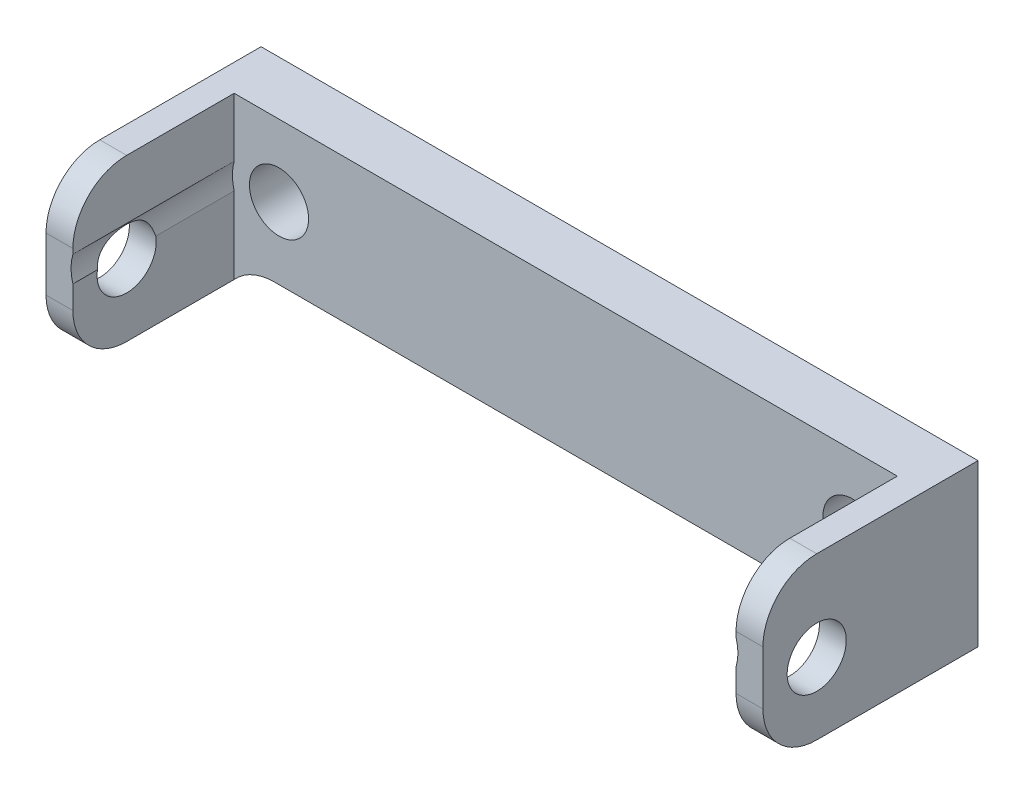
ISO-10303-21;
HEADER;
FILE_DESCRIPTION(('STEP AP214'),'2;1');
FILE_NAME('part.step','',(''),(''),'','','');
FILE_SCHEMA(('AUTOMOTIVE_DESIGN { 1 0 10303 214 1 1 1 1 }'));
ENDSEC;
DATA;
#1=APPLICATION_CONTEXT('core data for automotive mechanical design processes');
#2=APPLICATION_PROTOCOL_DEFINITION('international standard','automotive_design',2000,#1);
#3=PRODUCT_CONTEXT('',#1,'mechanical');
#4=PRODUCT('Part','Part','',(#3));
#5=PRODUCT_RELATED_PRODUCT_CATEGORY('part','',(#4));
#6=PRODUCT_DEFINITION_FORMATION('','',#4);
#7=PRODUCT_DEFINITION_CONTEXT('part definition',#1,'design');
#8=PRODUCT_DEFINITION('design','',#6,#7);
#9=PRODUCT_DEFINITION_SHAPE('','',#8);
#10=(LENGTH_UNIT() NAMED_UNIT(*) SI_UNIT(.MILLI.,.METRE.));
#11=(NAMED_UNIT(*) PLANE_ANGLE_UNIT() SI_UNIT($,.RADIAN.));
#12=(NAMED_UNIT(*) SI_UNIT($,.STERADIAN.) SOLID_ANGLE_UNIT());
#13=UNCERTAINTY_MEASURE_WITH_UNIT(LENGTH_MEASURE(1.E-05),#10,'distance_accuracy_value','');
#14=(GEOMETRIC_REPRESENTATION_CONTEXT(3) GLOBAL_UNCERTAINTY_ASSIGNED_CONTEXT((#13)) GLOBAL_UNIT_ASSIGNED_CONTEXT((#10,
#11,#12)) REPRESENTATION_CONTEXT('',''));
#15=CARTESIAN_POINT('',(0.,0.,0.));
#16=DIRECTION('',(0.,0.,1.));
#17=DIRECTION('',(1.,0.,0.));
#18=AXIS2_PLACEMENT_3D('',#15,#16,#17);
#19=CARTESIAN_POINT('',(18.5,0.,0.));
#20=DIRECTION('',(1.,0.,0.));
#21=DIRECTION('',(0.,0.,1.));
#22=AXIS2_PLACEMENT_3D('',#19,#20,#21);
#23=PLANE('',#22);
#24=DIRECTION('',(0.,0.,1.));
#25=VECTOR('',#24,1.);
#26=CARTESIAN_POINT('',(18.5,0.714142842854289,-4.35391052434009));
#27=LINE('',#26,#25);
#28=CARTESIAN_POINT('',(18.5,0.714142842854289,12.));
#29=VERTEX_POINT('',#28);
#30=CARTESIAN_POINT('',(18.5,0.714142842854289,3.));
#31=VERTEX_POINT('',#30);
#32=EDGE_CURVE('E179',#29,#31,#27,.F.);
#33=ORIENTED_EDGE('',*,*,#32,.F.);
#34=DIRECTION('',(0.,1.,0.));
#35=VECTOR('',#34,1.);
#36=CARTESIAN_POINT('',(18.5,-5.,12.));
#37=LINE('',#36,#35);
#38=CARTESIAN_POINT('',(18.5,1.,12.));
#39=VERTEX_POINT('',#38);
#40=EDGE_CURVE('E400',#29,#39,#37,.T.);
#41=ORIENTED_EDGE('',*,*,#40,.T.);
#42=CARTESIAN_POINT('',(18.5,1.,9.));
#43=DIRECTION('',(1.,0.,0.));
#44=DIRECTION('',(0.,0.,-1.));
#45=AXIS2_PLACEMENT_3D('',#42,#43,#44);
#46=CIRCLE('',#45,3.);
#47=CARTESIAN_POINT('',(18.5,4.,9.));
#48=VERTEX_POINT('',#47);
#49=EDGE_CURVE('E317',#39,#48,#46,.F.);
#50=ORIENTED_EDGE('',*,*,#49,.T.);
#51=DIRECTION('',(0.,0.,-1.));
#52=VECTOR('',#51,1.);
#53=CARTESIAN_POINT('',(18.5,4.,12.));
#54=LINE('',#53,#52);
#55=CARTESIAN_POINT('',(18.5,4.,3.));
#56=VERTEX_POINT('',#55);
#57=EDGE_CURVE('E201',#48,#56,#54,.T.);
#58=ORIENTED_EDGE('',*,*,#57,.T.);
#59=DIRECTION('',(0.,1.,0.));
#60=VECTOR('',#59,1.);
#61=CARTESIAN_POINT('',(18.5,0.,3.));
#62=LINE('',#61,#60);
#63=EDGE_CURVE('E194',#31,#56,#62,.T.);
#64=ORIENTED_EDGE('',*,*,#63,.F.);
#65=EDGE_LOOP('',(#33,#41,#50,#58,#64));
#66=FACE_BOUND('',#65,.T.);
#67=ADVANCED_FACE('F32',(#66),#23,.F.);
#68=DIRECTION('',(0.,0.,1.));
#69=VECTOR('',#68,1.);
#70=CARTESIAN_POINT('',(18.5,-0.714142842854289,-4.35391052434009));
#71=LINE('',#70,#69);
#72=CARTESIAN_POINT('',(18.5,-0.714142842854289,3.));
#73=VERTEX_POINT('',#72);
#74=CARTESIAN_POINT('',(18.5,-0.714142842854289,7.37495055899564));
#75=VERTEX_POINT('',#74);
#76=EDGE_CURVE('E53',#73,#75,#71,.T.);
#77=ORIENTED_EDGE('',*,*,#76,.F.);
#78=CARTESIAN_POINT('',(18.5,-5.,3.));
#79=VERTEX_POINT('',#78);
#80=EDGE_CURVE('E197',#79,#73,#62,.T.);
#81=ORIENTED_EDGE('',*,*,#80,.F.);
#82=DIRECTION('',(0.,0.,1.));
#83=VECTOR('',#82,1.);
#84=CARTESIAN_POINT('',(18.5,-5.,0.));
#85=LINE('',#84,#83);
#86=CARTESIAN_POINT('',(18.5,-5.,9.));
#87=VERTEX_POINT('',#86);
#88=EDGE_CURVE('E388',#79,#87,#85,.T.);
#89=ORIENTED_EDGE('',*,*,#88,.T.);
#90=CARTESIAN_POINT('',(18.5,-2.,9.));
#91=DIRECTION('',(1.,0.,0.));
#92=DIRECTION('',(0.,0.,-1.));
#93=AXIS2_PLACEMENT_3D('',#90,#91,#92);
#94=CIRCLE('',#93,3.);
#95=CARTESIAN_POINT('',(18.5,-2.,12.));
#96=VERTEX_POINT('',#95);
#97=EDGE_CURVE('E361',#87,#96,#94,.F.);
#98=ORIENTED_EDGE('',*,*,#97,.T.);
#99=CARTESIAN_POINT('',(18.5,-0.714142842854289,12.));
#100=VERTEX_POINT('',#99);
#101=EDGE_CURVE('E391',#96,#100,#37,.T.);
#102=ORIENTED_EDGE('',*,*,#101,.T.);
#103=CARTESIAN_POINT('',(18.5,-0.714142842854289,10.6250494410044));
#104=VERTEX_POINT('',#103);
#105=EDGE_CURVE('E198',#104,#100,#71,.T.);
#106=ORIENTED_EDGE('',*,*,#105,.F.);
#107=CARTESIAN_POINT('',(18.5,-1.,9.));
#108=DIRECTION('',(-1.,0.,0.));
#109=DIRECTION('',(0.,0.,1.));
#110=AXIS2_PLACEMENT_3D('',#107,#108,#109);
#111=CIRCLE('',#110,1.65);
#112=EDGE_CURVE('E399',#75,#104,#111,.T.);
#113=ORIENTED_EDGE('',*,*,#112,.F.);
#114=EDGE_LOOP('',(#77,#81,#89,#98,#102,#106,#113));
#115=FACE_BOUND('',#114,.T.);
#116=ADVANCED_FACE('F338',(#115),#23,.F.);
#117=CARTESIAN_POINT('',(18.5,-1.,9.));
#118=DIRECTION('',(1.,0.,0.));
#119=DIRECTION('',(0.,0.,-1.));
#120=AXIS2_PLACEMENT_3D('',#117,#118,#119);
#121=CYLINDRICAL_SURFACE('',#120,1.65);
#122=CARTESIAN_POINT('',(20.,-1.,9.));
#123=DIRECTION('',(-1.,0.,0.));
#124=DIRECTION('',(0.,0.,1.));
#125=AXIS2_PLACEMENT_3D('',#122,#123,#124);
#126=CIRCLE('',#125,1.65);
#127=CARTESIAN_POINT('',(20.,-1.,10.65));
#128=VERTEX_POINT('',#127);
#129=EDGE_CURVE('E188',#128,#128,#126,.T.);
#130=ORIENTED_EDGE('',*,*,#129,.F.);
#131=EDGE_LOOP('',(#130));
#132=FACE_BOUND('',#131,.T.);
#133=ORIENTED_EDGE('',*,*,#112,.T.);
#134=CARTESIAN_POINT('',(18.5,-0.714142842854289,10.6250494410044));
#135=CARTESIAN_POINT('',(18.5112002641301,-0.674963148021333,10.6181656181267));
#136=CARTESIAN_POINT('',(18.5213955006599,-0.635756650168365,10.6098001749673));
#137=CARTESIAN_POINT('',(18.5398118219877,-0.557633663923848,10.5901030763082));
#138=CARTESIAN_POINT('',(18.5480332389028,-0.518717127812292,10.5787719204942));
#139=CARTESIAN_POINT('',(18.5625121881789,-0.441660633773743,10.5531900241132));
#140=CARTESIAN_POINT('',(18.5687775403161,-0.40351816881584,10.5389512951452));
#141=CARTESIAN_POINT('',(18.5794850737174,-0.328186728807253,10.5075922435592));
#142=CARTESIAN_POINT('',(18.5839272860553,-0.290997737515662,10.4904719700613));
#143=CARTESIAN_POINT('',(18.5947058792569,-0.181323126524409,10.4349089077362));
#144=CARTESIAN_POINT('',(18.5985058300217,-0.110664973550308,10.3922424395216));
#145=CARTESIAN_POINT('',(18.6007638832804,0.0235186807734739,10.2968077126242));
#146=CARTESIAN_POINT('',(18.5992185626588,0.0870395845339693,10.2440330010547));
#147=CARTESIAN_POINT('',(18.5924402577824,0.20737958749524,10.1278118411849));
#148=CARTESIAN_POINT('',(18.587085944113,0.263904335064964,10.0640680588727));
#149=CARTESIAN_POINT('',(18.5745689017903,0.366428331698654,9.92875658729636));
#150=CARTESIAN_POINT('',(18.5674052917974,0.41242243022477,9.85718509468111));
#151=CARTESIAN_POINT('',(18.5525951353871,0.496207391415172,9.70163517556041));
#152=CARTESIAN_POINT('',(18.5449574847043,0.533008876574704,9.61712032706635));
#153=CARTESIAN_POINT('',(18.5318710870563,0.592074076040213,9.44300067534401));
#154=CARTESIAN_POINT('',(18.526421972392,0.614340232841647,9.35339673003232));
#155=CARTESIAN_POINT('',(18.5191088274974,0.643681621834425,9.17128760592471));
#156=CARTESIAN_POINT('',(18.5172560106779,0.650709347898161,9.07877426376673));
#157=CARTESIAN_POINT('',(18.5176515619581,0.649177468321693,8.89389443081547));
#158=CARTESIAN_POINT('',(18.5198995102909,0.640619458085751,8.80152792596013));
#159=CARTESIAN_POINT('',(18.5278055230787,0.608650138985056,8.62205850380448));
#160=CARTESIAN_POINT('',(18.5333734968331,0.58563040234764,8.53488118505168));
#161=CARTESIAN_POINT('',(18.5464643105675,0.525786646079553,8.3655352783981));
#162=CARTESIAN_POINT('',(18.5539878992446,0.48895733713012,8.28336862371112));
#163=CARTESIAN_POINT('',(18.5692366497016,0.40130737225064,8.12403114947191));
#164=CARTESIAN_POINT('',(18.57696191221,0.350144426282177,8.04704839354661));
#165=CARTESIAN_POINT('',(18.5899468381871,0.235563676466304,7.90255808113818));
#166=CARTESIAN_POINT('',(18.5952067765206,0.172147239903009,7.83504946894897));
#167=CARTESIAN_POINT('',(18.6006687780622,0.0349210511148269,7.71161614382046));
#168=CARTESIAN_POINT('',(18.6008822808755,-0.0388648126259045,7.65566551615414));
#169=CARTESIAN_POINT('',(18.5938790207487,-0.194491333886152,7.55704735164802));
#170=CARTESIAN_POINT('',(18.5866717878813,-0.276321538539568,7.51436286931238));
#171=CARTESIAN_POINT('',(18.5668384133902,-0.417983131154916,7.45479705091917));
#172=CARTESIAN_POINT('',(18.5566567356135,-0.476557858798861,7.43402574615374));
#173=CARTESIAN_POINT('',(18.5317775045769,-0.594813717389484,7.39932787439475));
#174=CARTESIAN_POINT('',(18.5170766485,-0.65449562743892,7.38540633292944));
#175=CARTESIAN_POINT('',(18.5,-0.714142842854289,7.37495055899564));
#176=B_SPLINE_CURVE_WITH_KNOTS('',3,(#134,#135,#136,#137,#138,#139,#140,#141,#142,#143,#144,
#145,#146,#147,#148,#149,#150,#151,#152,#153,#154,#155,#156,#157,#158,#159,#160,#161,#162,#163,
#164,#165,#166,#167,#168,#169,#170,#171,#172,#173,#174,#175),.UNSPECIFIED.,.F.,.F.,(4,2,2,2,2,2,
2,2,2,2,2,2,2,2,2,2,2,2,2,2,4),(0.,0.123940731596514,0.247860594146849,0.371278522765075,
0.494694347756643,0.741320735951038,0.988105093093169,1.24312415414578,1.49826767977024,
1.77445348885693,2.05059287612694,2.32759190337916,2.60456257774635,2.87433923395027,
3.14421932527272,3.42119260806131,3.69813500310403,3.97444954582673,4.25040967393518,
4.43882353318531,4.6273754223823),.UNSPECIFIED.);
#177=EDGE_CURVE('E11',#104,#75,#176,.T.);
#178=ORIENTED_EDGE('',*,*,#177,.T.);
#179=EDGE_LOOP('',(#133,#178));
#180=FACE_BOUND('',#179,.T.);
#181=ADVANCED_FACE('F339',(#132,#180),#121,.F.);
#182=CARTESIAN_POINT('',(0.,0.,3.));
#183=DIRECTION('',(0.,0.,1.));
#184=DIRECTION('',(1.,0.,0.));
#185=AXIS2_PLACEMENT_3D('',#182,#183,#184);
#186=PLANE('',#185);
#187=CARTESIAN_POINT('',(-16.,0.,3.));
#188=DIRECTION('',(0.,0.,1.));
#189=DIRECTION('',(1.,0.,0.));
#190=AXIS2_PLACEMENT_3D('',#187,#188,#189);
#191=CIRCLE('',#190,1.65);
#192=CARTESIAN_POINT('',(-14.35,0.,3.));
#193=VERTEX_POINT('',#192);
#194=EDGE_CURVE('E258',#193,#193,#191,.T.);
#195=ORIENTED_EDGE('',*,*,#194,.F.);
#196=EDGE_LOOP('',(#195));
#197=FACE_BOUND('',#196,.T.);
#198=ORIENTED_EDGE('',*,*,#80,.T.);
#199=CARTESIAN_POINT('',(16.,0.,3.));
#200=DIRECTION('',(0.,0.,1.));
#201=DIRECTION('',(1.,0.,0.));
#202=AXIS2_PLACEMENT_3D('',#199,#200,#201);
#203=CIRCLE('',#202,2.6);
#204=EDGE_CURVE('E182',#73,#31,#203,.T.);
#205=ORIENTED_EDGE('',*,*,#204,.T.);
#206=ORIENTED_EDGE('',*,*,#63,.T.);
#207=DIRECTION('',(-1.,0.,0.));
#208=VECTOR('',#207,1.);
#209=CARTESIAN_POINT('',(-20.,4.,3.));
#210=LINE('',#209,#208);
#211=CARTESIAN_POINT('',(-18.5,4.,3.));
#212=VERTEX_POINT('',#211);
#213=EDGE_CURVE('E264',#56,#212,#210,.T.);
#214=ORIENTED_EDGE('',*,*,#213,.T.);
#215=DIRECTION('',(0.,-1.,0.));
#216=VECTOR('',#215,1.);
#217=CARTESIAN_POINT('',(-18.5,0.,3.));
#218=LINE('',#217,#216);
#219=CARTESIAN_POINT('',(-18.5,0.714142842854289,3.));
#220=VERTEX_POINT('',#219);
#221=EDGE_CURVE('E248',#212,#220,#218,.T.);
#222=ORIENTED_EDGE('',*,*,#221,.T.);
#223=CARTESIAN_POINT('',(-16.,0.,3.));
#224=DIRECTION('',(0.,0.,1.));
#225=DIRECTION('',(1.,0.,0.));
#226=AXIS2_PLACEMENT_3D('',#223,#224,#225);
#227=CIRCLE('',#226,2.6);
#228=CARTESIAN_POINT('',(-18.5,-0.714142842854289,3.));
#229=VERTEX_POINT('',#228);
#230=EDGE_CURVE('E212',#229,#220,#227,.F.);
#231=ORIENTED_EDGE('',*,*,#230,.F.);
#232=CARTESIAN_POINT('',(-18.5,-5.,3.));
#233=VERTEX_POINT('',#232);
#234=EDGE_CURVE('E247',#229,#233,#218,.T.);
#235=ORIENTED_EDGE('',*,*,#234,.T.);
#236=CARTESIAN_POINT('',(-16.2639320225002,-7.,3.));
#237=DIRECTION('',(0.,0.,1.));
#238=DIRECTION('',(1.,0.,0.));
#239=AXIS2_PLACEMENT_3D('',#236,#237,#238);
#240=CIRCLE('',#239,3.);
#241=CARTESIAN_POINT('',(-16.2639320225002,-4.,3.));
#242=VERTEX_POINT('',#241);
#243=EDGE_CURVE('E304',#233,#242,#240,.F.);
#244=ORIENTED_EDGE('',*,*,#243,.T.);
#245=DIRECTION('',(1.,0.,0.));
#246=VECTOR('',#245,1.);
#247=CARTESIAN_POINT('',(-20.,-4.,3.));
#248=LINE('',#247,#246);
#249=CARTESIAN_POINT('',(16.2639320225002,-4.,3.));
#250=VERTEX_POINT('',#249);
#251=EDGE_CURVE('E266',#242,#250,#248,.T.);
#252=ORIENTED_EDGE('',*,*,#251,.T.);
#253=CARTESIAN_POINT('',(16.2639320225002,-7.,3.));
#254=DIRECTION('',(0.,0.,1.));
#255=DIRECTION('',(1.,0.,0.));
#256=AXIS2_PLACEMENT_3D('',#253,#254,#255);
#257=CIRCLE('',#256,3.);
#258=EDGE_CURVE('E46',#250,#79,#257,.F.);
#259=ORIENTED_EDGE('',*,*,#258,.T.);
#260=EDGE_LOOP('',(#198,#205,#206,#214,#222,#231,#235,#244,#252,#259));
#261=FACE_BOUND('',#260,.T.);
#262=CARTESIAN_POINT('',(16.,0.,3.));
#263=DIRECTION('',(0.,0.,1.));
#264=DIRECTION('',(-1.,0.,0.));
#265=AXIS2_PLACEMENT_3D('',#262,#263,#264);
#266=CIRCLE('',#265,1.65);
#267=CARTESIAN_POINT('',(14.35,0.,3.));
#268=VERTEX_POINT('',#267);
#269=EDGE_CURVE('E252',#268,#268,#266,.T.);
#270=ORIENTED_EDGE('',*,*,#269,.F.);
#271=EDGE_LOOP('',(#270));
#272=FACE_BOUND('',#271,.T.);
#273=ADVANCED_FACE('F192',(#197,#261,#272),#186,.T.);
#274=CARTESIAN_POINT('',(-20.,-4.,3.));
#275=DIRECTION('',(0.,1.,0.));
#276=DIRECTION('',(0.,0.,1.));
#277=AXIS2_PLACEMENT_3D('',#274,#275,#276);
#278=PLANE('',#277);
#279=DIRECTION('',(1.,0.,0.));
#280=VECTOR('',#279,1.);
#281=CARTESIAN_POINT('',(-20.,-4.,0.));
#282=LINE('',#281,#280);
#283=CARTESIAN_POINT('',(-16.2639320225002,-4.,0.));
#284=VERTEX_POINT('',#283);
#285=CARTESIAN_POINT('',(16.2639320225002,-4.,0.));
#286=VERTEX_POINT('',#285);
#287=EDGE_CURVE('E267',#284,#286,#282,.T.);
#288=ORIENTED_EDGE('',*,*,#287,.T.);
#289=DIRECTION('',(0.,0.,1.));
#290=VECTOR('',#289,1.);
#291=CARTESIAN_POINT('',(16.2639320225002,-4.,3.));
#292=LINE('',#291,#290);
#293=EDGE_CURVE('E362',#286,#250,#292,.T.);
#294=ORIENTED_EDGE('',*,*,#293,.T.);
#295=ORIENTED_EDGE('',*,*,#251,.F.);
#296=DIRECTION('',(0.,0.,1.));
#297=VECTOR('',#296,1.);
#298=CARTESIAN_POINT('',(-16.2639320225002,-4.,3.));
#299=LINE('',#298,#297);
#300=EDGE_CURVE('E288',#242,#284,#299,.F.);
#301=ORIENTED_EDGE('',*,*,#300,.T.);
#302=EDGE_LOOP('',(#288,#294,#295,#301));
#303=FACE_BOUND('',#302,.T.);
#304=ADVANCED_FACE('F426',(#303),#278,.F.);
#305=CARTESIAN_POINT('',(-18.5,0.,0.));
#306=DIRECTION('',(-1.,0.,0.));
#307=DIRECTION('',(0.,0.,1.));
#308=AXIS2_PLACEMENT_3D('',#305,#306,#307);
#309=PLANE('',#308);
#310=ORIENTED_EDGE('',*,*,#234,.F.);
#311=DIRECTION('',(0.,0.,1.));
#312=VECTOR('',#311,1.);
#313=CARTESIAN_POINT('',(-18.5,-0.714142842854289,-4.35391052434009));
#314=LINE('',#313,#312);
#315=CARTESIAN_POINT('',(-18.5,-0.714142842854289,7.37495055899564));
#316=VERTEX_POINT('',#315);
#317=EDGE_CURVE('E217',#229,#316,#314,.T.);
#318=ORIENTED_EDGE('',*,*,#317,.T.);
#319=CARTESIAN_POINT('',(-18.5,-1.,9.));
#320=DIRECTION('',(-1.,0.,0.));
#321=DIRECTION('',(0.,0.,1.));
#322=AXIS2_PLACEMENT_3D('',#319,#320,#321);
#323=CIRCLE('',#322,1.65);
#324=CARTESIAN_POINT('',(-18.5,-0.714142842854289,10.6250494410044));
#325=VERTEX_POINT('',#324);
#326=EDGE_CURVE('E222',#316,#325,#323,.T.);
#327=ORIENTED_EDGE('',*,*,#326,.T.);
#328=CARTESIAN_POINT('',(-18.5,-0.714142842854289,12.));
#329=VERTEX_POINT('',#328);
#330=EDGE_CURVE('E214',#325,#329,#314,.T.);
#331=ORIENTED_EDGE('',*,*,#330,.T.);
#332=DIRECTION('',(0.,1.,0.));
#333=VECTOR('',#332,1.);
#334=CARTESIAN_POINT('',(-18.5,-5.,12.));
#335=LINE('',#334,#333);
#336=CARTESIAN_POINT('',(-18.5,-2.,12.));
#337=VERTEX_POINT('',#336);
#338=EDGE_CURVE('E233',#337,#329,#335,.T.);
#339=ORIENTED_EDGE('',*,*,#338,.F.);
#340=CARTESIAN_POINT('',(-18.5,-2.,9.));
#341=DIRECTION('',(-1.,0.,0.));
#342=DIRECTION('',(0.,0.,1.));
#343=AXIS2_PLACEMENT_3D('',#340,#341,#342);
#344=CIRCLE('',#343,3.);
#345=CARTESIAN_POINT('',(-18.5,-5.,9.));
#346=VERTEX_POINT('',#345);
#347=EDGE_CURVE('E286',#337,#346,#344,.F.);
#348=ORIENTED_EDGE('',*,*,#347,.T.);
#349=DIRECTION('',(0.,0.,1.));
#350=VECTOR('',#349,1.);
#351=CARTESIAN_POINT('',(-18.5,-5.,0.));
#352=LINE('',#351,#350);
#353=EDGE_CURVE('E232',#233,#346,#352,.T.);
#354=ORIENTED_EDGE('',*,*,#353,.F.);
#355=EDGE_LOOP('',(#310,#318,#327,#331,#339,#348,#354));
#356=FACE_BOUND('',#355,.T.);
#357=ADVANCED_FACE('F434',(#356),#309,.F.);
#358=CARTESIAN_POINT('',(0.,0.,0.));
#359=DIRECTION('',(0.,0.,1.));
#360=DIRECTION('',(1.,0.,0.));
#361=AXIS2_PLACEMENT_3D('',#358,#359,#360);
#362=PLANE('',#361);
#363=DIRECTION('',(0.,1.,0.));
#364=VECTOR('',#363,1.);
#365=CARTESIAN_POINT('',(20.,4.,0.));
#366=LINE('',#365,#364);
#367=CARTESIAN_POINT('',(20.,-5.,0.));
#368=VERTEX_POINT('',#367);
#369=CARTESIAN_POINT('',(20.,4.,0.));
#370=VERTEX_POINT('',#369);
#371=EDGE_CURVE('E261',#368,#370,#366,.T.);
#372=ORIENTED_EDGE('',*,*,#371,.F.);
#373=DIRECTION('',(1.,0.,0.));
#374=VECTOR('',#373,1.);
#375=CARTESIAN_POINT('',(18.5,-5.,0.));
#376=LINE('',#375,#374);
#377=CARTESIAN_POINT('',(18.5,-5.,0.));
#378=VERTEX_POINT('',#377);
#379=EDGE_CURVE('E203',#378,#368,#376,.T.);
#380=ORIENTED_EDGE('',*,*,#379,.F.);
#381=CARTESIAN_POINT('',(16.2639320225002,-7.,0.));
#382=DIRECTION('',(0.,0.,1.));
#383=DIRECTION('',(1.,0.,0.));
#384=AXIS2_PLACEMENT_3D('',#381,#382,#383);
#385=CIRCLE('',#384,3.);
#386=EDGE_CURVE('E380',#378,#286,#385,.T.);
#387=ORIENTED_EDGE('',*,*,#386,.T.);
#388=ORIENTED_EDGE('',*,*,#287,.F.);
#389=CARTESIAN_POINT('',(-16.2639320225002,-7.,0.));
#390=DIRECTION('',(0.,0.,1.));
#391=DIRECTION('',(1.,0.,0.));
#392=AXIS2_PLACEMENT_3D('',#389,#390,#391);
#393=CIRCLE('',#392,3.);
#394=CARTESIAN_POINT('',(-18.5,-5.,0.));
#395=VERTEX_POINT('',#394);
#396=EDGE_CURVE('E306',#284,#395,#393,.T.);
#397=ORIENTED_EDGE('',*,*,#396,.T.);
#398=DIRECTION('',(-1.,0.,0.));
#399=VECTOR('',#398,1.);
#400=CARTESIAN_POINT('',(-18.5,-5.,0.));
#401=LINE('',#400,#399);
#402=CARTESIAN_POINT('',(-20.,-5.,0.));
#403=VERTEX_POINT('',#402);
#404=EDGE_CURVE('E239',#395,#403,#401,.T.);
#405=ORIENTED_EDGE('',*,*,#404,.T.);
#406=DIRECTION('',(0.,-1.,0.));
#407=VECTOR('',#406,1.);
#408=CARTESIAN_POINT('',(-20.,4.,0.));
#409=LINE('',#408,#407);
#410=CARTESIAN_POINT('',(-20.,4.,0.));
#411=VERTEX_POINT('',#410);
#412=EDGE_CURVE('E275',#411,#403,#409,.T.);
#413=ORIENTED_EDGE('',*,*,#412,.F.);
#414=DIRECTION('',(-1.,0.,0.));
#415=VECTOR('',#414,1.);
#416=CARTESIAN_POINT('',(-20.,4.,0.));
#417=LINE('',#416,#415);
#418=EDGE_CURVE('E273',#370,#411,#417,.T.);
#419=ORIENTED_EDGE('',*,*,#418,.F.);
#420=EDGE_LOOP('',(#372,#380,#387,#388,#397,#405,#413,#419));
#421=FACE_BOUND('',#420,.T.);
#422=CARTESIAN_POINT('',(-16.,0.,0.));
#423=DIRECTION('',(0.,0.,1.));
#424=DIRECTION('',(1.,0.,0.));
#425=AXIS2_PLACEMENT_3D('',#422,#423,#424);
#426=CIRCLE('',#425,1.65);
#427=CARTESIAN_POINT('',(-14.35,0.,0.));
#428=VERTEX_POINT('',#427);
#429=EDGE_CURVE('E255',#428,#428,#426,.T.);
#430=ORIENTED_EDGE('',*,*,#429,.T.);
#431=EDGE_LOOP('',(#430));
#432=FACE_BOUND('',#431,.T.);
#433=CARTESIAN_POINT('',(16.,0.,0.));
#434=DIRECTION('',(0.,0.,1.));
#435=DIRECTION('',(-1.,0.,0.));
#436=AXIS2_PLACEMENT_3D('',#433,#434,#435);
#437=CIRCLE('',#436,1.65);
#438=CARTESIAN_POINT('',(14.35,0.,0.));
#439=VERTEX_POINT('',#438);
#440=EDGE_CURVE('E251',#439,#439,#437,.T.);
#441=ORIENTED_EDGE('',*,*,#440,.T.);
#442=EDGE_LOOP('',(#441));
#443=FACE_BOUND('',#442,.T.);
#444=ADVANCED_FACE('F443',(#421,#432,#443),#362,.F.);
#445=CARTESIAN_POINT('',(20.,4.,3.));
#446=DIRECTION('',(-1.,0.,0.));
#447=DIRECTION('',(0.,0.,1.));
#448=AXIS2_PLACEMENT_3D('',#445,#446,#447);
#449=PLANE('',#448);
#450=DIRECTION('',(0.,1.,0.));
#451=VECTOR('',#450,1.);
#452=CARTESIAN_POINT('',(20.,-5.,12.));
#453=LINE('',#452,#451);
#454=CARTESIAN_POINT('',(20.,-2.,12.));
#455=VERTEX_POINT('',#454);
#456=CARTESIAN_POINT('',(20.,1.,12.));
#457=VERTEX_POINT('',#456);
#458=EDGE_CURVE('E396',#455,#457,#453,.T.);
#459=ORIENTED_EDGE('',*,*,#458,.F.);
#460=CARTESIAN_POINT('',(20.,-2.,9.));
#461=DIRECTION('',(-1.,0.,0.));
#462=DIRECTION('',(0.,0.,1.));
#463=AXIS2_PLACEMENT_3D('',#460,#461,#462);
#464=CIRCLE('',#463,3.);
#465=CARTESIAN_POINT('',(20.,-5.,9.));
#466=VERTEX_POINT('',#465);
#467=EDGE_CURVE('E60',#455,#466,#464,.F.);
#468=ORIENTED_EDGE('',*,*,#467,.T.);
#469=DIRECTION('',(0.,0.,1.));
#470=VECTOR('',#469,1.);
#471=CARTESIAN_POINT('',(20.,-5.,0.));
#472=LINE('',#471,#470);
#473=EDGE_CURVE('E398',#368,#466,#472,.T.);
#474=ORIENTED_EDGE('',*,*,#473,.F.);
#475=ORIENTED_EDGE('',*,*,#371,.T.);
#476=DIRECTION('',(0.,0.,-1.));
#477=VECTOR('',#476,1.);
#478=CARTESIAN_POINT('',(20.,4.,3.));
#479=LINE('',#478,#477);
#480=CARTESIAN_POINT('',(20.,4.,9.));
#481=VERTEX_POINT('',#480);
#482=EDGE_CURVE('E281',#481,#370,#479,.T.);
#483=ORIENTED_EDGE('',*,*,#482,.F.);
#484=CARTESIAN_POINT('',(20.,1.,9.));
#485=DIRECTION('',(-1.,0.,0.));
#486=DIRECTION('',(0.,0.,1.));
#487=AXIS2_PLACEMENT_3D('',#484,#485,#486);
#488=CIRCLE('',#487,3.);
#489=EDGE_CURVE('E374',#481,#457,#488,.F.);
#490=ORIENTED_EDGE('',*,*,#489,.T.);
#491=EDGE_LOOP('',(#459,#468,#474,#475,#483,#490));
#492=FACE_BOUND('',#491,.T.);
#493=ORIENTED_EDGE('',*,*,#129,.T.);
#494=EDGE_LOOP('',(#493));
#495=FACE_BOUND('',#494,.T.);
#496=ADVANCED_FACE('F452',(#492,#495),#449,.F.);
#497=CARTESIAN_POINT('',(-20.,4.,3.));
#498=DIRECTION('',(0.,-1.,0.));
#499=DIRECTION('',(0.,0.,-1.));
#500=AXIS2_PLACEMENT_3D('',#497,#498,#499);
#501=PLANE('',#500);
#502=ORIENTED_EDGE('',*,*,#57,.F.);
#503=DIRECTION('',(1.,0.,0.));
#504=VECTOR('',#503,1.);
#505=CARTESIAN_POINT('',(-20.,4.,9.));
#506=LINE('',#505,#504);
#507=EDGE_CURVE('E360',#48,#481,#506,.T.);
#508=ORIENTED_EDGE('',*,*,#507,.T.);
#509=ORIENTED_EDGE('',*,*,#482,.T.);
#510=ORIENTED_EDGE('',*,*,#418,.T.);
#511=DIRECTION('',(0.,0.,-1.));
#512=VECTOR('',#511,1.);
#513=CARTESIAN_POINT('',(-20.,4.,3.));
#514=LINE('',#513,#512);
#515=CARTESIAN_POINT('',(-20.,4.,9.));
#516=VERTEX_POINT('',#515);
#517=EDGE_CURVE('E270',#516,#411,#514,.T.);
#518=ORIENTED_EDGE('',*,*,#517,.F.);
#519=DIRECTION('',(-1.,0.,0.));
#520=VECTOR('',#519,1.);
#521=CARTESIAN_POINT('',(-18.5,4.,9.));
#522=LINE('',#521,#520);
#523=CARTESIAN_POINT('',(-18.5,4.,9.));
#524=VERTEX_POINT('',#523);
#525=EDGE_CURVE('E302',#516,#524,#522,.F.);
#526=ORIENTED_EDGE('',*,*,#525,.T.);
#527=DIRECTION('',(0.,0.,-1.));
#528=VECTOR('',#527,1.);
#529=CARTESIAN_POINT('',(-18.5,4.,12.));
#530=LINE('',#529,#528);
#531=EDGE_CURVE('E236',#524,#212,#530,.T.);
#532=ORIENTED_EDGE('',*,*,#531,.T.);
#533=ORIENTED_EDGE('',*,*,#213,.F.);
#534=EDGE_LOOP('',(#502,#508,#509,#510,#518,#526,#532,#533));
#535=FACE_BOUND('',#534,.T.);
#536=ADVANCED_FACE('F460',(#535),#501,.F.);
#537=CARTESIAN_POINT('',(-20.,4.,3.));
#538=DIRECTION('',(1.,0.,0.));
#539=DIRECTION('',(0.,0.,-1.));
#540=AXIS2_PLACEMENT_3D('',#537,#538,#539);
#541=PLANE('',#540);
#542=DIRECTION('',(0.,0.,1.));
#543=VECTOR('',#542,1.);
#544=CARTESIAN_POINT('',(-20.,-5.,0.));
#545=LINE('',#544,#543);
#546=CARTESIAN_POINT('',(-20.,-5.,9.));
#547=VERTEX_POINT('',#546);
#548=EDGE_CURVE('E225',#403,#547,#545,.T.);
#549=ORIENTED_EDGE('',*,*,#548,.T.);
#550=CARTESIAN_POINT('',(-20.,-2.,9.));
#551=DIRECTION('',(1.,0.,0.));
#552=DIRECTION('',(0.,0.,-1.));
#553=AXIS2_PLACEMENT_3D('',#550,#551,#552);
#554=CIRCLE('',#553,3.);
#555=CARTESIAN_POINT('',(-20.,-2.,12.));
#556=VERTEX_POINT('',#555);
#557=EDGE_CURVE('E295',#547,#556,#554,.F.);
#558=ORIENTED_EDGE('',*,*,#557,.T.);
#559=DIRECTION('',(0.,1.,0.));
#560=VECTOR('',#559,1.);
#561=CARTESIAN_POINT('',(-20.,-5.,12.));
#562=LINE('',#561,#560);
#563=CARTESIAN_POINT('',(-20.,1.,12.));
#564=VERTEX_POINT('',#563);
#565=EDGE_CURVE('E242',#556,#564,#562,.T.);
#566=ORIENTED_EDGE('',*,*,#565,.T.);
#567=CARTESIAN_POINT('',(-20.,1.,9.));
#568=DIRECTION('',(1.,0.,0.));
#569=DIRECTION('',(0.,0.,-1.));
#570=AXIS2_PLACEMENT_3D('',#567,#568,#569);
#571=CIRCLE('',#570,3.);
#572=EDGE_CURVE('E293',#564,#516,#571,.F.);
#573=ORIENTED_EDGE('',*,*,#572,.T.);
#574=ORIENTED_EDGE('',*,*,#517,.T.);
#575=ORIENTED_EDGE('',*,*,#412,.T.);
#576=EDGE_LOOP('',(#549,#558,#566,#573,#574,#575));
#577=FACE_BOUND('',#576,.T.);
#578=CARTESIAN_POINT('',(-20.,-1.,9.));
#579=DIRECTION('',(-1.,0.,0.));
#580=DIRECTION('',(0.,0.,1.));
#581=AXIS2_PLACEMENT_3D('',#578,#579,#580);
#582=CIRCLE('',#581,1.65);
#583=CARTESIAN_POINT('',(-20.,-1.,10.65));
#584=VERTEX_POINT('',#583);
#585=EDGE_CURVE('E221',#584,#584,#582,.T.);
#586=ORIENTED_EDGE('',*,*,#585,.F.);
#587=EDGE_LOOP('',(#586));
#588=FACE_BOUND('',#587,.T.);
#589=ADVANCED_FACE('F467',(#577,#588),#541,.F.);
#590=CARTESIAN_POINT('',(-16.,0.,3.));
#591=DIRECTION('',(0.,0.,-1.));
#592=DIRECTION('',(-1.,0.,0.));
#593=AXIS2_PLACEMENT_3D('',#590,#591,#592);
#594=CYLINDRICAL_SURFACE('',#593,1.65);
#595=ORIENTED_EDGE('',*,*,#194,.T.);
#596=EDGE_LOOP('',(#595));
#597=FACE_BOUND('',#596,.T.);
#598=ORIENTED_EDGE('',*,*,#429,.F.);
#599=EDGE_LOOP('',(#598));
#600=FACE_BOUND('',#599,.T.);
#601=ADVANCED_FACE('F476',(#597,#600),#594,.F.);
#602=CARTESIAN_POINT('',(16.,0.,3.));
#603=DIRECTION('',(0.,0.,-1.));
#604=DIRECTION('',(-1.,0.,0.));
#605=AXIS2_PLACEMENT_3D('',#602,#603,#604);
#606=CYLINDRICAL_SURFACE('',#605,1.65);
#607=ORIENTED_EDGE('',*,*,#269,.T.);
#608=EDGE_LOOP('',(#607));
#609=FACE_BOUND('',#608,.T.);
#610=ORIENTED_EDGE('',*,*,#440,.F.);
#611=EDGE_LOOP('',(#610));
#612=FACE_BOUND('',#611,.T.);
#613=ADVANCED_FACE('F486',(#609,#612),#606,.F.);
#614=CARTESIAN_POINT('',(-18.5,-5.,12.));
#615=DIRECTION('',(0.,0.,1.));
#616=DIRECTION('',(1.,0.,0.));
#617=AXIS2_PLACEMENT_3D('',#614,#615,#616);
#618=PLANE('',#617);
#619=CARTESIAN_POINT('',(-16.,0.,12.));
#620=DIRECTION('',(0.,0.,1.));
#621=DIRECTION('',(1.,0.,0.));
#622=AXIS2_PLACEMENT_3D('',#619,#620,#621);
#623=CIRCLE('',#622,2.6);
#624=CARTESIAN_POINT('',(-18.5,0.714142842854289,12.));
#625=VERTEX_POINT('',#624);
#626=EDGE_CURVE('E205',#625,#329,#623,.T.);
#627=ORIENTED_EDGE('',*,*,#626,.F.);
#628=CARTESIAN_POINT('',(-18.5,1.,12.));
#629=VERTEX_POINT('',#628);
#630=EDGE_CURVE('E231',#625,#629,#335,.T.);
#631=ORIENTED_EDGE('',*,*,#630,.T.);
#632=DIRECTION('',(-1.,0.,0.));
#633=VECTOR('',#632,1.);
#634=CARTESIAN_POINT('',(-20.,1.,12.));
#635=LINE('',#634,#633);
#636=EDGE_CURVE('E297',#629,#564,#635,.T.);
#637=ORIENTED_EDGE('',*,*,#636,.T.);
#638=ORIENTED_EDGE('',*,*,#565,.F.);
#639=DIRECTION('',(-1.,0.,0.));
#640=VECTOR('',#639,1.);
#641=CARTESIAN_POINT('',(-18.5,-2.,12.));
#642=LINE('',#641,#640);
#643=EDGE_CURVE('E300',#556,#337,#642,.F.);
#644=ORIENTED_EDGE('',*,*,#643,.T.);
#645=ORIENTED_EDGE('',*,*,#338,.T.);
#646=EDGE_LOOP('',(#627,#631,#637,#638,#644,#645));
#647=FACE_BOUND('',#646,.T.);
#648=ADVANCED_FACE('F493',(#647),#618,.T.);
#649=CARTESIAN_POINT('',(-18.5,-5.,0.));
#650=DIRECTION('',(0.,-1.,0.));
#651=DIRECTION('',(0.,0.,-1.));
#652=AXIS2_PLACEMENT_3D('',#649,#650,#651);
#653=PLANE('',#652);
#654=ORIENTED_EDGE('',*,*,#353,.T.);
#655=DIRECTION('',(-1.,0.,0.));
#656=VECTOR('',#655,1.);
#657=CARTESIAN_POINT('',(-18.5,-5.,9.));
#658=LINE('',#657,#656);
#659=EDGE_CURVE('E290',#346,#547,#658,.T.);
#660=ORIENTED_EDGE('',*,*,#659,.T.);
#661=ORIENTED_EDGE('',*,*,#548,.F.);
#662=ORIENTED_EDGE('',*,*,#404,.F.);
#663=EDGE_CURVE('E228',#395,#233,#352,.T.);
#664=ORIENTED_EDGE('',*,*,#663,.T.);
#665=EDGE_LOOP('',(#654,#660,#661,#662,#664));
#666=FACE_BOUND('',#665,.T.);
#667=ADVANCED_FACE('F500',(#666),#653,.T.);
#668=ORIENTED_EDGE('',*,*,#630,.F.);
#669=DIRECTION('',(0.,0.,1.));
#670=VECTOR('',#669,1.);
#671=CARTESIAN_POINT('',(-18.5,0.714142842854289,-4.35391052434009));
#672=LINE('',#671,#670);
#673=EDGE_CURVE('E218',#625,#220,#672,.F.);
#674=ORIENTED_EDGE('',*,*,#673,.T.);
#675=ORIENTED_EDGE('',*,*,#221,.F.);
#676=ORIENTED_EDGE('',*,*,#531,.F.);
#677=CARTESIAN_POINT('',(-18.5,1.,9.));
#678=DIRECTION('',(-1.,0.,0.));
#679=DIRECTION('',(0.,0.,1.));
#680=AXIS2_PLACEMENT_3D('',#677,#678,#679);
#681=CIRCLE('',#680,3.);
#682=EDGE_CURVE('E283',#524,#629,#681,.F.);
#683=ORIENTED_EDGE('',*,*,#682,.T.);
#684=EDGE_LOOP('',(#668,#674,#675,#676,#683));
#685=FACE_BOUND('',#684,.T.);
#686=ADVANCED_FACE('F445',(#685),#309,.F.);
#687=CARTESIAN_POINT('',(-18.5,-1.,9.));
#688=DIRECTION('',(-1.,0.,0.));
#689=DIRECTION('',(0.,0.,1.));
#690=AXIS2_PLACEMENT_3D('',#687,#688,#689);
#691=CYLINDRICAL_SURFACE('',#690,1.65);
#692=ORIENTED_EDGE('',*,*,#326,.F.);
#693=CARTESIAN_POINT('',(-18.5,-0.714142842854289,7.37495055899564));
#694=CARTESIAN_POINT('',(-18.5112002641301,-0.674963148021333,7.38183438187333));
#695=CARTESIAN_POINT('',(-18.5213955006599,-0.635756650168365,7.39019982503267));
#696=CARTESIAN_POINT('',(-18.5398118219877,-0.557633663923848,7.4098969236918));
#697=CARTESIAN_POINT('',(-18.5480332389028,-0.518717127812292,7.42122807950584));
#698=CARTESIAN_POINT('',(-18.5625121881789,-0.441660633773743,7.44680997588676));
#699=CARTESIAN_POINT('',(-18.5687775403161,-0.40351816881584,7.46104870485477));
#700=CARTESIAN_POINT('',(-18.5794850737174,-0.328186728807253,7.49240775644084));
#701=CARTESIAN_POINT('',(-18.5839272860553,-0.290997737515662,7.50952802993873));
#702=CARTESIAN_POINT('',(-18.5947058792569,-0.181323126524409,7.56509109226378));
#703=CARTESIAN_POINT('',(-18.5985058300217,-0.110664973550309,7.60775756047838));
#704=CARTESIAN_POINT('',(-18.6007638832804,0.0235186807734736,7.70319228737584));
#705=CARTESIAN_POINT('',(-18.5992185626588,0.0870395845339689,7.75596699894535));
#706=CARTESIAN_POINT('',(-18.5924402577824,0.20737958749524,7.87218815881506));
#707=CARTESIAN_POINT('',(-18.587085944113,0.263904335064964,7.93593194112731));
#708=CARTESIAN_POINT('',(-18.5745689017903,0.366428331698654,8.07124341270364));
#709=CARTESIAN_POINT('',(-18.5674052917974,0.41242243022477,8.14281490531888));
#710=CARTESIAN_POINT('',(-18.5525951353871,0.496207391415171,8.29836482443959));
#711=CARTESIAN_POINT('',(-18.5449574847043,0.533008876574704,8.38287967293365));
#712=CARTESIAN_POINT('',(-18.5318710870563,0.592074076040213,8.55699932465599));
#713=CARTESIAN_POINT('',(-18.526421972392,0.614340232841647,8.64660326996767));
#714=CARTESIAN_POINT('',(-18.5191088274974,0.643681621834425,8.82871239407529));
#715=CARTESIAN_POINT('',(-18.5172560106779,0.650709347898161,8.92122573623327));
#716=CARTESIAN_POINT('',(-18.5176515619581,0.649177468321693,9.10610556918453));
#717=CARTESIAN_POINT('',(-18.5198995102909,0.640619458085751,9.19847207403987));
#718=CARTESIAN_POINT('',(-18.5278055230787,0.608650138985056,9.37794149619552));
#719=CARTESIAN_POINT('',(-18.5333734968331,0.58563040234764,9.46511881494832));
#720=CARTESIAN_POINT('',(-18.5464643105675,0.525786646079553,9.6344647216019));
#721=CARTESIAN_POINT('',(-18.5539878992446,0.488957337130121,9.71663137628888));
#722=CARTESIAN_POINT('',(-18.5692366497016,0.40130737225064,9.87596885052808));
#723=CARTESIAN_POINT('',(-18.57696191221,0.350144426282177,9.95295160645339));
#724=CARTESIAN_POINT('',(-18.5899468381871,0.235563676466304,10.0974419188618));
#725=CARTESIAN_POINT('',(-18.5952067765206,0.172147239903009,10.164950531051));
#726=CARTESIAN_POINT('',(-18.6006687780622,0.0349210511148272,10.2883838561795));
#727=CARTESIAN_POINT('',(-18.6008822808755,-0.0388648126259041,10.3443344838459));
#728=CARTESIAN_POINT('',(-18.5938790207487,-0.194491333886152,10.442952648352));
#729=CARTESIAN_POINT('',(-18.5866717878813,-0.276321538539568,10.4856371306876));
#730=CARTESIAN_POINT('',(-18.5668384133902,-0.417983131154917,10.5452029490808));
#731=CARTESIAN_POINT('',(-18.5566567356135,-0.476557858798862,10.5659742538463));
#732=CARTESIAN_POINT('',(-18.5317775045769,-0.594813717389485,10.6006721256052));
#733=CARTESIAN_POINT('',(-18.5170766485,-0.654495627438921,10.6145936670706));
#734=CARTESIAN_POINT('',(-18.5,-0.71414284285429,10.6250494410044));
#735=B_SPLINE_CURVE_WITH_KNOTS('',3,(#693,#694,#695,#696,#697,#698,#699,#700,#701,#702,#703,
#704,#705,#706,#707,#708,#709,#710,#711,#712,#713,#714,#715,#716,#717,#718,#719,#720,#721,#722,
#723,#724,#725,#726,#727,#728,#729,#730,#731,#732,#733,#734),.UNSPECIFIED.,.F.,.F.,(4,2,2,2,2,2,
2,2,2,2,2,2,2,2,2,2,2,2,2,2,4),(0.,0.123940731596514,0.247860594146849,0.371278522765074,
0.494694347756643,0.741320735951037,0.988105093093169,1.24312415414578,1.49826767977024,
1.77445348885693,2.05059287612693,2.32759190337916,2.60456257774635,2.87433923395027,
3.14421932527272,3.42119260806131,3.69813500310403,3.97444954582673,4.25040967393518,
4.43882353318531,4.62737542238231),.UNSPECIFIED.);
#736=EDGE_CURVE('E308',#316,#325,#735,.T.);
#737=ORIENTED_EDGE('',*,*,#736,.T.);
#738=EDGE_LOOP('',(#692,#737));
#739=FACE_BOUND('',#738,.T.);
#740=ORIENTED_EDGE('',*,*,#585,.T.);
#741=EDGE_LOOP('',(#740));
#742=FACE_BOUND('',#741,.T.);
#743=ADVANCED_FACE('F319',(#739,#742),#691,.F.);
#744=CARTESIAN_POINT('',(-16.2639320225002,-7.,0.));
#745=DIRECTION('',(0.,0.,1.));
#746=DIRECTION('',(1.,0.,0.));
#747=AXIS2_PLACEMENT_3D('',#744,#745,#746);
#748=CYLINDRICAL_SURFACE('',#747,3.);
#749=ORIENTED_EDGE('',*,*,#396,.F.);
#750=ORIENTED_EDGE('',*,*,#300,.F.);
#751=ORIENTED_EDGE('',*,*,#243,.F.);
#752=ORIENTED_EDGE('',*,*,#663,.F.);
#753=EDGE_LOOP('',(#749,#750,#751,#752));
#754=FACE_BOUND('',#753,.T.);
#755=ADVANCED_FACE('F521',(#754),#748,.F.);
#756=CARTESIAN_POINT('',(-18.5,-2.,9.));
#757=DIRECTION('',(-1.,0.,0.));
#758=DIRECTION('',(0.,0.,1.));
#759=AXIS2_PLACEMENT_3D('',#756,#757,#758);
#760=CYLINDRICAL_SURFACE('',#759,3.);
#761=ORIENTED_EDGE('',*,*,#347,.F.);
#762=ORIENTED_EDGE('',*,*,#643,.F.);
#763=ORIENTED_EDGE('',*,*,#557,.F.);
#764=ORIENTED_EDGE('',*,*,#659,.F.);
#765=EDGE_LOOP('',(#761,#762,#763,#764));
#766=FACE_BOUND('',#765,.T.);
#767=ADVANCED_FACE('F528',(#766),#760,.T.);
#768=CARTESIAN_POINT('',(-18.5,1.,9.));
#769=DIRECTION('',(1.,0.,0.));
#770=DIRECTION('',(0.,0.,-1.));
#771=AXIS2_PLACEMENT_3D('',#768,#769,#770);
#772=CYLINDRICAL_SURFACE('',#771,3.);
#773=ORIENTED_EDGE('',*,*,#682,.F.);
#774=ORIENTED_EDGE('',*,*,#525,.F.);
#775=ORIENTED_EDGE('',*,*,#572,.F.);
#776=ORIENTED_EDGE('',*,*,#636,.F.);
#777=EDGE_LOOP('',(#773,#774,#775,#776));
#778=FACE_BOUND('',#777,.T.);
#779=ADVANCED_FACE('F327',(#778),#772,.T.);
#780=CARTESIAN_POINT('',(-16.,0.,-4.35391052434009));
#781=DIRECTION('',(0.,0.,1.));
#782=DIRECTION('',(1.,0.,0.));
#783=AXIS2_PLACEMENT_3D('',#780,#781,#782);
#784=CYLINDRICAL_SURFACE('',#783,2.6);
#785=ORIENTED_EDGE('',*,*,#626,.T.);
#786=ORIENTED_EDGE('',*,*,#330,.F.);
#787=ORIENTED_EDGE('',*,*,#736,.F.);
#788=ORIENTED_EDGE('',*,*,#317,.F.);
#789=ORIENTED_EDGE('',*,*,#230,.T.);
#790=ORIENTED_EDGE('',*,*,#673,.F.);
#791=EDGE_LOOP('',(#785,#786,#787,#788,#789,#790));
#792=FACE_BOUND('',#791,.T.);
#793=ADVANCED_FACE('F322',(#792),#784,.F.);
#794=CARTESIAN_POINT('',(18.5,-5.,0.));
#795=DIRECTION('',(0.,1.,0.));
#796=DIRECTION('',(0.,0.,1.));
#797=AXIS2_PLACEMENT_3D('',#794,#795,#796);
#798=PLANE('',#797);
#799=ORIENTED_EDGE('',*,*,#473,.T.);
#800=DIRECTION('',(1.,0.,0.));
#801=VECTOR('',#800,1.);
#802=CARTESIAN_POINT('',(18.5,-5.,9.));
#803=LINE('',#802,#801);
#804=EDGE_CURVE('E377',#466,#87,#803,.F.);
#805=ORIENTED_EDGE('',*,*,#804,.T.);
#806=ORIENTED_EDGE('',*,*,#88,.F.);
#807=EDGE_CURVE('E207',#378,#79,#85,.T.);
#808=ORIENTED_EDGE('',*,*,#807,.F.);
#809=ORIENTED_EDGE('',*,*,#379,.T.);
#810=EDGE_LOOP('',(#799,#805,#806,#808,#809));
#811=FACE_BOUND('',#810,.T.);
#812=ADVANCED_FACE('F326',(#811),#798,.F.);
#813=CARTESIAN_POINT('',(18.5,-5.,12.));
#814=DIRECTION('',(0.,0.,-1.));
#815=DIRECTION('',(-1.,0.,0.));
#816=AXIS2_PLACEMENT_3D('',#813,#814,#815);
#817=PLANE('',#816);
#818=CARTESIAN_POINT('',(16.,0.,12.));
#819=DIRECTION('',(0.,0.,-1.));
#820=DIRECTION('',(-1.,0.,0.));
#821=AXIS2_PLACEMENT_3D('',#818,#819,#820);
#822=CIRCLE('',#821,2.6);
#823=EDGE_CURVE('E184',#29,#100,#822,.T.);
#824=ORIENTED_EDGE('',*,*,#823,.T.);
#825=ORIENTED_EDGE('',*,*,#101,.F.);
#826=DIRECTION('',(1.,0.,0.));
#827=VECTOR('',#826,1.);
#828=CARTESIAN_POINT('',(18.5,-2.,12.));
#829=LINE('',#828,#827);
#830=EDGE_CURVE('E371',#96,#455,#829,.T.);
#831=ORIENTED_EDGE('',*,*,#830,.T.);
#832=ORIENTED_EDGE('',*,*,#458,.T.);
#833=DIRECTION('',(1.,0.,0.));
#834=VECTOR('',#833,1.);
#835=CARTESIAN_POINT('',(18.5,1.,12.));
#836=LINE('',#835,#834);
#837=EDGE_CURVE('E358',#457,#39,#836,.F.);
#838=ORIENTED_EDGE('',*,*,#837,.T.);
#839=ORIENTED_EDGE('',*,*,#40,.F.);
#840=EDGE_LOOP('',(#824,#825,#831,#832,#838,#839));
#841=FACE_BOUND('',#840,.T.);
#842=ADVANCED_FACE('F329',(#841),#817,.F.);
#843=CARTESIAN_POINT('',(16.2639320225002,-7.,0.));
#844=DIRECTION('',(0.,0.,1.));
#845=DIRECTION('',(1.,0.,0.));
#846=AXIS2_PLACEMENT_3D('',#843,#844,#845);
#847=CYLINDRICAL_SURFACE('',#846,3.);
#848=ORIENTED_EDGE('',*,*,#258,.F.);
#849=ORIENTED_EDGE('',*,*,#293,.F.);
#850=ORIENTED_EDGE('',*,*,#386,.F.);
#851=ORIENTED_EDGE('',*,*,#807,.T.);
#852=EDGE_LOOP('',(#848,#849,#850,#851));
#853=FACE_BOUND('',#852,.T.);
#854=ADVANCED_FACE('F332',(#853),#847,.F.);
#855=CARTESIAN_POINT('',(18.5,-2.,9.));
#856=DIRECTION('',(1.,0.,0.));
#857=DIRECTION('',(0.,0.,-1.));
#858=AXIS2_PLACEMENT_3D('',#855,#856,#857);
#859=CYLINDRICAL_SURFACE('',#858,3.);
#860=ORIENTED_EDGE('',*,*,#97,.F.);
#861=ORIENTED_EDGE('',*,*,#804,.F.);
#862=ORIENTED_EDGE('',*,*,#467,.F.);
#863=ORIENTED_EDGE('',*,*,#830,.F.);
#864=EDGE_LOOP('',(#860,#861,#862,#863));
#865=FACE_BOUND('',#864,.T.);
#866=ADVANCED_FACE('F348',(#865),#859,.T.);
#867=CARTESIAN_POINT('',(-20.,1.,9.));
#868=DIRECTION('',(1.,0.,0.));
#869=DIRECTION('',(0.,0.,-1.));
#870=AXIS2_PLACEMENT_3D('',#867,#868,#869);
#871=CYLINDRICAL_SURFACE('',#870,3.);
#872=ORIENTED_EDGE('',*,*,#49,.F.);
#873=ORIENTED_EDGE('',*,*,#837,.F.);
#874=ORIENTED_EDGE('',*,*,#489,.F.);
#875=ORIENTED_EDGE('',*,*,#507,.F.);
#876=EDGE_LOOP('',(#872,#873,#874,#875));
#877=FACE_BOUND('',#876,.T.);
#878=ADVANCED_FACE('F34',(#877),#871,.T.);
#879=CARTESIAN_POINT('',(16.,0.,-4.35391052434009));
#880=DIRECTION('',(0.,0.,1.));
#881=DIRECTION('',(1.,0.,0.));
#882=AXIS2_PLACEMENT_3D('',#879,#880,#881);
#883=CYLINDRICAL_SURFACE('',#882,2.6);
#884=ORIENTED_EDGE('',*,*,#32,.T.);
#885=ORIENTED_EDGE('',*,*,#204,.F.);
#886=ORIENTED_EDGE('',*,*,#76,.T.);
#887=ORIENTED_EDGE('',*,*,#177,.F.);
#888=ORIENTED_EDGE('',*,*,#105,.T.);
#889=ORIENTED_EDGE('',*,*,#823,.F.);
#890=EDGE_LOOP('',(#884,#885,#886,#887,#888,#889));
#891=FACE_BOUND('',#890,.T.);
#892=ADVANCED_FACE('F181',(#891),#883,.F.);
#893=CLOSED_SHELL('',(#67,#116,#181,#273,#304,#357,#444,#496,#536,#589,#601,#613,#648,#667,#686,
#743,#755,#767,#779,#793,#812,#842,#854,#866,#878,#892));
#894=MANIFOLD_SOLID_BREP('B2',#893);
#895=ADVANCED_BREP_SHAPE_REPRESENTATION('',(#18,#894),#14);
#896=SHAPE_DEFINITION_REPRESENTATION(#9,#895);
ENDSEC;
END-ISO-10303-21;
